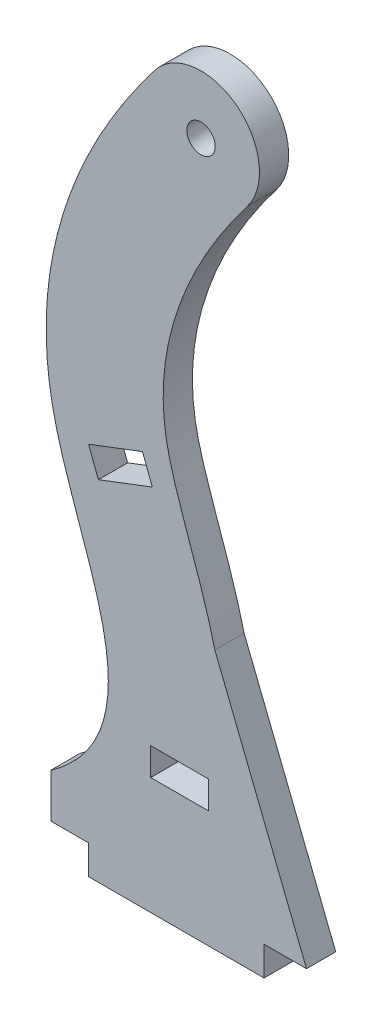
ISO-10303-21;
HEADER;
FILE_DESCRIPTION(('STEP AP214'),'2;1');
FILE_NAME('part.step','',(''),(''),'','','');
FILE_SCHEMA(('AUTOMOTIVE_DESIGN { 1 0 10303 214 1 1 1 1 }'));
ENDSEC;
DATA;
#1=APPLICATION_CONTEXT('core data for automotive mechanical design processes');
#2=APPLICATION_PROTOCOL_DEFINITION('international standard','automotive_design',2000,#1);
#3=PRODUCT_CONTEXT('',#1,'mechanical');
#4=PRODUCT('Part','Part','',(#3));
#5=PRODUCT_RELATED_PRODUCT_CATEGORY('part','',(#4));
#6=PRODUCT_DEFINITION_FORMATION('','',#4);
#7=PRODUCT_DEFINITION_CONTEXT('part definition',#1,'design');
#8=PRODUCT_DEFINITION('design','',#6,#7);
#9=PRODUCT_DEFINITION_SHAPE('','',#8);
#10=(LENGTH_UNIT() NAMED_UNIT(*) SI_UNIT(.MILLI.,.METRE.));
#11=(NAMED_UNIT(*) PLANE_ANGLE_UNIT() SI_UNIT($,.RADIAN.));
#12=(NAMED_UNIT(*) SI_UNIT($,.STERADIAN.) SOLID_ANGLE_UNIT());
#13=UNCERTAINTY_MEASURE_WITH_UNIT(LENGTH_MEASURE(1.E-05),#10,'distance_accuracy_value','');
#14=(GEOMETRIC_REPRESENTATION_CONTEXT(3) GLOBAL_UNCERTAINTY_ASSIGNED_CONTEXT((#13)) GLOBAL_UNIT_ASSIGNED_CONTEXT((#10,
#11,#12)) REPRESENTATION_CONTEXT('',''));
#15=CARTESIAN_POINT('',(0.,0.,0.));
#16=DIRECTION('',(0.,0.,1.));
#17=DIRECTION('',(1.,0.,0.));
#18=AXIS2_PLACEMENT_3D('',#15,#16,#17);
#19=CARTESIAN_POINT('',(25.0101807006285,84.5536828977521,6.35));
#20=DIRECTION('',(0.,0.,-1.));
#21=DIRECTION('',(-1.,0.,0.));
#22=AXIS2_PLACEMENT_3D('',#19,#20,#21);
#23=PLANE('',#22);
#24=DIRECTION('',(-0.934118417079502,-0.35696327944606,0.));
#25=VECTOR('',#24,1.);
#26=CARTESIAN_POINT('',(8.17063216998378,74.9558549784725,6.35));
#27=LINE('',#26,#25);
#28=CARTESIAN_POINT('',(19.8678498123375,79.4258205563523,6.35));
#29=VERTEX_POINT('',#28);
#30=CARTESIAN_POINT('',(8.17063216998378,74.9558549784725,6.35));
#31=VERTEX_POINT('',#30);
#32=EDGE_CURVE('E195',#29,#31,#27,.T.);
#33=ORIENTED_EDGE('',*,*,#32,.F.);
#34=DIRECTION('',(-0.356963279446075,0.934118417079496,0.));
#35=VECTOR('',#34,1.);
#36=CARTESIAN_POINT('',(19.8678498123375,79.4258205563523,6.35));
#37=LINE('',#36,#35);
#38=CARTESIAN_POINT('',(22.0076304946488,73.8263411170115,6.35));
#39=VERTEX_POINT('',#38);
#40=EDGE_CURVE('E203',#39,#29,#37,.T.);
#41=ORIENTED_EDGE('',*,*,#40,.F.);
#42=DIRECTION('',(0.934118417079486,0.356963279446101,0.));
#43=VECTOR('',#42,1.);
#44=CARTESIAN_POINT('',(10.3104128522954,69.3563755391312,6.35));
#45=LINE('',#44,#43);
#46=CARTESIAN_POINT('',(10.3104128522954,69.3563755391312,6.35));
#47=VERTEX_POINT('',#46);
#48=EDGE_CURVE('E200',#47,#39,#45,.T.);
#49=ORIENTED_EDGE('',*,*,#48,.F.);
#50=DIRECTION('',(0.356963279446085,-0.934118417079492,0.));
#51=VECTOR('',#50,1.);
#52=CARTESIAN_POINT('',(8.17063216998378,74.9558549784725,6.35));
#53=LINE('',#52,#51);
#54=EDGE_CURVE('E197',#31,#47,#53,.T.);
#55=ORIENTED_EDGE('',*,*,#54,.F.);
#56=EDGE_LOOP('',(#33,#41,#49,#55));
#57=FACE_BOUND('',#56,.T.);
#58=DIRECTION('',(0.,-1.,0.));
#59=VECTOR('',#58,1.);
#60=CARTESIAN_POINT('',(0.,9.58967568861893,6.35));
#61=LINE('',#60,#59);
#62=CARTESIAN_POINT('',(0.,9.58967568861893,6.35));
#63=VERTEX_POINT('',#62);
#64=CARTESIAN_POINT('',(0.,0.,6.35));
#65=VERTEX_POINT('',#64);
#66=EDGE_CURVE('E232',#63,#65,#61,.T.);
#67=ORIENTED_EDGE('',*,*,#66,.T.);
#68=DIRECTION('',(1.,0.,0.));
#69=VECTOR('',#68,1.);
#70=CARTESIAN_POINT('',(0.,0.,6.35));
#71=LINE('',#70,#69);
#72=CARTESIAN_POINT('',(8.17063216998378,0.,6.35));
#73=VERTEX_POINT('',#72);
#74=EDGE_CURVE('E235',#65,#73,#71,.T.);
#75=ORIENTED_EDGE('',*,*,#74,.T.);
#76=DIRECTION('',(0.,-1.,0.));
#77=VECTOR('',#76,1.);
#78=CARTESIAN_POINT('',(8.17063216998378,0.,6.35));
#79=LINE('',#78,#77);
#80=CARTESIAN_POINT('',(8.17063216998378,-6.35,6.35));
#81=VERTEX_POINT('',#80);
#82=EDGE_CURVE('E238',#73,#81,#79,.T.);
#83=ORIENTED_EDGE('',*,*,#82,.T.);
#84=DIRECTION('',(1.,0.,0.));
#85=VECTOR('',#84,1.);
#86=CARTESIAN_POINT('',(8.17063216998378,-6.35,6.35));
#87=LINE('',#86,#85);
#88=CARTESIAN_POINT('',(46.2706321699838,-6.35,6.35));
#89=VERTEX_POINT('',#88);
#90=EDGE_CURVE('E240',#81,#89,#87,.T.);
#91=ORIENTED_EDGE('',*,*,#90,.T.);
#92=DIRECTION('',(0.,1.,0.));
#93=VECTOR('',#92,1.);
#94=CARTESIAN_POINT('',(46.2706321699838,-6.35,6.35));
#95=LINE('',#94,#93);
#96=CARTESIAN_POINT('',(46.2706321699838,0.,6.35));
#97=VERTEX_POINT('',#96);
#98=EDGE_CURVE('E242',#89,#97,#95,.T.);
#99=ORIENTED_EDGE('',*,*,#98,.T.);
#100=DIRECTION('',(1.,0.,0.));
#101=VECTOR('',#100,1.);
#102=CARTESIAN_POINT('',(46.2706321699838,0.,6.35));
#103=LINE('',#102,#101);
#104=CARTESIAN_POINT('',(55.4885743427861,0.,6.35));
#105=VERTEX_POINT('',#104);
#106=EDGE_CURVE('E244',#97,#105,#103,.T.);
#107=ORIENTED_EDGE('',*,*,#106,.T.);
#108=CARTESIAN_POINT('',(55.4885743427861,0.,6.35));
#109=CARTESIAN_POINT('',(35.5939281580711,49.9715125701587,6.35));
#110=B_SPLINE_CURVE_WITH_KNOTS('',1,(#108,#109),.UNSPECIFIED.,.F.,.F.,(2,2),(0.,1.),.UNSPECIFIED.);
#111=CARTESIAN_POINT('',(35.5939281580711,49.9715125701587,6.35));
#112=VERTEX_POINT('',#111);
#113=EDGE_CURVE('E246',#105,#112,#110,.T.);
#114=ORIENTED_EDGE('',*,*,#113,.T.);
#115=CARTESIAN_POINT('',(14.6386440832059,-11.1677350219014,6.35));
#116=CARTESIAN_POINT('',(15.993719372111,-10.2121021090652,6.35));
#117=CARTESIAN_POINT('',(18.6402892410642,-8.1940524023132,6.35));
#118=CARTESIAN_POINT('',(23.5424406836985,-3.78692886840914,6.35));
#119=CARTESIAN_POINT('',(28.8938100236488,2.46550629347578,6.35));
#120=CARTESIAN_POINT('',(33.6864094872974,10.9103784146669,6.35));
#121=CARTESIAN_POINT('',(36.6378927286633,19.7198119349582,6.35));
#122=CARTESIAN_POINT('',(37.9073212789025,28.2753270232658,6.35));
#123=CARTESIAN_POINT('',(37.894551928186,37.5741979738703,6.35));
#124=CARTESIAN_POINT('',(36.6428624642127,45.8140619811913,6.35));
#125=CARTESIAN_POINT('',(34.5822500472398,54.1219459431517,6.35));
#126=CARTESIAN_POINT('',(31.957417171032,62.3483443135577,6.35));
#127=CARTESIAN_POINT('',(29.4490520894029,69.3391781164023,6.35));
#128=CARTESIAN_POINT('',(27.5788127696835,74.8012961992338,6.35));
#129=CARTESIAN_POINT('',(26.4239352428472,78.4798507817565,6.35));
#130=CARTESIAN_POINT('',(25.5548509095228,81.728738298571,6.35));
#131=CARTESIAN_POINT('',(24.7882337027435,85.4836599545439,6.35));
#132=CARTESIAN_POINT('',(24.284352637122,90.3086123825321,6.35));
#133=CARTESIAN_POINT('',(24.4281830062934,96.2033561498626,6.35));
#134=CARTESIAN_POINT('',(25.3275851118725,102.354497695581,6.35));
#135=CARTESIAN_POINT('',(27.029689584325,108.787993916917,6.35));
#136=CARTESIAN_POINT('',(29.5776249981555,115.505437796637,6.35));
#137=CARTESIAN_POINT('',(32.4312242663498,121.30914400608,6.35));
#138=CARTESIAN_POINT('',(35.1580660147539,126.048842881338,6.35));
#139=CARTESIAN_POINT('',(37.4240805437192,129.643418636195,6.35));
#140=CARTESIAN_POINT('',(39.4975569447407,132.668231109225,6.35));
#141=CARTESIAN_POINT('',(41.2616819639979,135.095684908051,6.35));
#142=CARTESIAN_POINT('',(42.1865011732246,136.321547482478,6.35));
#143=CARTESIAN_POINT('',(42.6515160265804,136.926910036438,6.35));
#144=B_SPLINE_CURVE_WITH_KNOTS('',3,(#115,#116,#117,#118,#119,#120,#121,#122,#123,#124,#125,
#126,#127,#128,#129,#130,#131,#132,#133,#134,#135,#136,#137,#138,#139,#140,#141,#142,#143),
.UNSPECIFIED.,.F.,.F.,(4,1,1,1,1,1,1,1,1,1,1,1,1,1,1,1,1,1,1,1,1,1,1,1,1,1,4),(0.,0.015625,
0.03125,0.0625,0.09375,0.125,0.15625,0.1875,0.234812185903787,0.266062185903787,0.3125,0.375,
0.40625,0.4375,0.46875,0.5,0.5625,0.625,0.6875,0.75,0.8125,0.875,0.90625,0.9375,0.96875,
0.984375,1.),.UNSPECIFIED.);
#145=CARTESIAN_POINT('',(42.6515160265804,136.926910036438,6.35));
#146=VERTEX_POINT('',#145);
#147=EDGE_CURVE('E250',#112,#146,#144,.T.);
#148=ORIENTED_EDGE('',*,*,#147,.T.);
#149=CARTESIAN_POINT('',(32.5799783214988,144.663455018219,6.35));
#150=DIRECTION('',(0.,0.,1.));
#151=DIRECTION('',(1.,0.,0.));
#152=AXIS2_PLACEMENT_3D('',#149,#150,#151);
#153=CIRCLE('',#152,12.7);
#154=CARTESIAN_POINT('',(22.5084406164172,152.4,6.35));
#155=VERTEX_POINT('',#154);
#156=EDGE_CURVE('E258',#146,#155,#153,.T.);
#157=ORIENTED_EDGE('',*,*,#156,.T.);
#158=CARTESIAN_POINT('',(22.5084406164172,152.4,6.35));
#159=CARTESIAN_POINT('',(3.94143346930532,128.229221830543,6.35));
#160=CARTESIAN_POINT('',(-7.63631862598279,94.0640014836905,6.35));
#161=CARTESIAN_POINT('',(11.3620522019621,46.5973364864593,6.35));
#162=CARTESIAN_POINT('',(16.9507047245258,21.5437357051744,6.35));
#163=CARTESIAN_POINT('',(0.,9.58967568861893,6.35));
#164=B_SPLINE_CURVE_WITH_KNOTS('',3,(#158,#159,#160,#161,#162,#163),.UNSPECIFIED.,.F.,.F.,(4,1,
1,4),(0.,0.519720096410352,0.687181480825465,1.),.UNSPECIFIED.);
#165=EDGE_CURVE('E314',#155,#63,#164,.T.);
#166=ORIENTED_EDGE('',*,*,#165,.T.);
#167=EDGE_LOOP('',(#67,#75,#83,#91,#99,#107,#114,#148,#157,#166));
#168=FACE_BOUND('',#167,.T.);
#169=CARTESIAN_POINT('',(32.5799783214988,144.663455018219,6.35));
#170=DIRECTION('',(0.,0.,1.));
#171=DIRECTION('',(1.,0.,0.));
#172=AXIS2_PLACEMENT_3D('',#169,#170,#171);
#173=CIRCLE('',#172,3.0861);
#174=CARTESIAN_POINT('',(35.6660783214988,144.663455018219,6.35));
#175=VERTEX_POINT('',#174);
#176=EDGE_CURVE('E226',#175,#175,#173,.T.);
#177=ORIENTED_EDGE('',*,*,#176,.F.);
#178=EDGE_LOOP('',(#177));
#179=FACE_BOUND('',#178,.T.);
#180=DIRECTION('',(0.,-1.,0.));
#181=VECTOR('',#180,1.);
#182=CARTESIAN_POINT('',(21.6637442400915,25.0331161416837,6.35));
#183=LINE('',#182,#181);
#184=CARTESIAN_POINT('',(21.6637442400915,25.0331161416837,6.35));
#185=VERTEX_POINT('',#184);
#186=CARTESIAN_POINT('',(21.6637442400915,19.0387161416837,6.35));
#187=VERTEX_POINT('',#186);
#188=EDGE_CURVE('E159',#185,#187,#183,.T.);
#189=ORIENTED_EDGE('',*,*,#188,.F.);
#190=DIRECTION('',(-1.,0.,0.));
#191=VECTOR('',#190,1.);
#192=CARTESIAN_POINT('',(21.6637442400915,25.0331161416837,6.35));
#193=LINE('',#192,#191);
#194=CARTESIAN_POINT('',(34.1859442400915,25.0331161416837,6.35));
#195=VERTEX_POINT('',#194);
#196=EDGE_CURVE('E181',#195,#185,#193,.T.);
#197=ORIENTED_EDGE('',*,*,#196,.F.);
#198=DIRECTION('',(0.,1.,0.));
#199=VECTOR('',#198,1.);
#200=CARTESIAN_POINT('',(34.1859442400915,25.0331161416837,6.35));
#201=LINE('',#200,#199);
#202=CARTESIAN_POINT('',(34.1859442400915,19.0387161416837,6.35));
#203=VERTEX_POINT('',#202);
#204=EDGE_CURVE('E179',#203,#195,#201,.T.);
#205=ORIENTED_EDGE('',*,*,#204,.F.);
#206=DIRECTION('',(1.,0.,0.));
#207=VECTOR('',#206,1.);
#208=CARTESIAN_POINT('',(21.6637442400915,19.0387161416837,6.35));
#209=LINE('',#208,#207);
#210=EDGE_CURVE('E167',#187,#203,#209,.T.);
#211=ORIENTED_EDGE('',*,*,#210,.F.);
#212=EDGE_LOOP('',(#189,#197,#205,#211));
#213=FACE_BOUND('',#212,.T.);
#214=ADVANCED_FACE('F34',(#57,#168,#179,#213),#23,.F.);
#215=CARTESIAN_POINT('',(25.0101807006285,84.5536828977521,0.));
#216=DIRECTION('',(0.,0.,-1.));
#217=DIRECTION('',(-1.,0.,0.));
#218=AXIS2_PLACEMENT_3D('',#215,#216,#217);
#219=PLANE('',#218);
#220=DIRECTION('',(0.,-1.,0.));
#221=VECTOR('',#220,1.);
#222=CARTESIAN_POINT('',(0.,9.58967568861893,0.));
#223=LINE('',#222,#221);
#224=CARTESIAN_POINT('',(0.,9.58967568861893,0.));
#225=VERTEX_POINT('',#224);
#226=CARTESIAN_POINT('',(0.,0.,0.));
#227=VERTEX_POINT('',#226);
#228=EDGE_CURVE('E229',#225,#227,#223,.T.);
#229=ORIENTED_EDGE('',*,*,#228,.F.);
#230=CARTESIAN_POINT('',(22.5084406164172,152.4,0.));
#231=CARTESIAN_POINT('',(3.94143346930532,128.229221830543,0.));
#232=CARTESIAN_POINT('',(-7.63631862598279,94.0640014836905,0.));
#233=CARTESIAN_POINT('',(11.3620522019621,46.5973364864593,0.));
#234=CARTESIAN_POINT('',(16.9507047245258,21.5437357051744,0.));
#235=CARTESIAN_POINT('',(0.,9.58967568861893,0.));
#236=B_SPLINE_CURVE_WITH_KNOTS('',3,(#230,#231,#232,#233,#234,#235),.UNSPECIFIED.,.F.,.F.,(4,1,
1,4),(0.,0.519720096410352,0.687181480825465,1.),.UNSPECIFIED.);
#237=CARTESIAN_POINT('',(22.5084406164172,152.4,0.));
#238=VERTEX_POINT('',#237);
#239=EDGE_CURVE('E236',#238,#225,#236,.T.);
#240=ORIENTED_EDGE('',*,*,#239,.F.);
#241=CARTESIAN_POINT('',(32.5799783214988,144.663455018219,0.));
#242=DIRECTION('',(0.,0.,1.));
#243=DIRECTION('',(1.,0.,0.));
#244=AXIS2_PLACEMENT_3D('',#241,#242,#243);
#245=CIRCLE('',#244,12.7);
#246=CARTESIAN_POINT('',(42.6515160265804,136.926910036438,0.));
#247=VERTEX_POINT('',#246);
#248=EDGE_CURVE('E346',#247,#238,#245,.T.);
#249=ORIENTED_EDGE('',*,*,#248,.F.);
#250=CARTESIAN_POINT('',(14.6386440832059,-11.1677350219014,0.));
#251=CARTESIAN_POINT('',(15.993719372111,-10.2121021090652,0.));
#252=CARTESIAN_POINT('',(18.6402892410642,-8.1940524023132,0.));
#253=CARTESIAN_POINT('',(23.5424406836985,-3.78692886840914,0.));
#254=CARTESIAN_POINT('',(28.8938100236488,2.46550629347578,0.));
#255=CARTESIAN_POINT('',(33.6864094872974,10.9103784146669,0.));
#256=CARTESIAN_POINT('',(36.6378927286633,19.7198119349582,0.));
#257=CARTESIAN_POINT('',(37.9073212789025,28.2753270232658,0.));
#258=CARTESIAN_POINT('',(37.894551928186,37.5741979738703,0.));
#259=CARTESIAN_POINT('',(36.6428624642127,45.8140619811913,0.));
#260=CARTESIAN_POINT('',(34.5822500472398,54.1219459431517,0.));
#261=CARTESIAN_POINT('',(31.957417171032,62.3483443135577,0.));
#262=CARTESIAN_POINT('',(29.4490520894029,69.3391781164023,0.));
#263=CARTESIAN_POINT('',(27.5788127696835,74.8012961992338,0.));
#264=CARTESIAN_POINT('',(26.4239352428472,78.4798507817565,0.));
#265=CARTESIAN_POINT('',(25.5548509095228,81.728738298571,0.));
#266=CARTESIAN_POINT('',(24.7882337027435,85.4836599545439,0.));
#267=CARTESIAN_POINT('',(24.284352637122,90.3086123825321,0.));
#268=CARTESIAN_POINT('',(24.4281830062934,96.2033561498626,0.));
#269=CARTESIAN_POINT('',(25.3275851118725,102.354497695581,0.));
#270=CARTESIAN_POINT('',(27.029689584325,108.787993916917,0.));
#271=CARTESIAN_POINT('',(29.5776249981555,115.505437796637,0.));
#272=CARTESIAN_POINT('',(32.4312242663498,121.30914400608,0.));
#273=CARTESIAN_POINT('',(35.1580660147539,126.048842881338,0.));
#274=CARTESIAN_POINT('',(37.4240805437192,129.643418636195,0.));
#275=CARTESIAN_POINT('',(39.4975569447407,132.668231109225,0.));
#276=CARTESIAN_POINT('',(41.2616819639979,135.095684908051,0.));
#277=CARTESIAN_POINT('',(42.1865011732246,136.321547482478,0.));
#278=CARTESIAN_POINT('',(42.6515160265804,136.926910036438,0.));
#279=B_SPLINE_CURVE_WITH_KNOTS('',3,(#250,#251,#252,#253,#254,#255,#256,#257,#258,#259,#260,
#261,#262,#263,#264,#265,#266,#267,#268,#269,#270,#271,#272,#273,#274,#275,#276,#277,#278),
.UNSPECIFIED.,.F.,.F.,(4,1,1,1,1,1,1,1,1,1,1,1,1,1,1,1,1,1,1,1,1,1,1,1,1,1,4),(0.,0.015625,
0.03125,0.0625,0.09375,0.125,0.15625,0.1875,0.234812185903787,0.266062185903787,0.3125,0.375,
0.40625,0.4375,0.46875,0.5,0.5625,0.625,0.6875,0.75,0.8125,0.875,0.90625,0.9375,0.96875,
0.984375,1.),.UNSPECIFIED.);
#280=CARTESIAN_POINT('',(35.5939281580711,49.9715125701587,0.));
#281=VERTEX_POINT('',#280);
#282=EDGE_CURVE('E339',#281,#247,#279,.T.);
#283=ORIENTED_EDGE('',*,*,#282,.F.);
#284=CARTESIAN_POINT('',(55.4885743427861,0.,0.));
#285=CARTESIAN_POINT('',(35.5939281580711,49.9715125701587,0.));
#286=B_SPLINE_CURVE_WITH_KNOTS('',1,(#284,#285),.UNSPECIFIED.,.F.,.F.,(2,2),(0.,1.),.UNSPECIFIED.);
#287=CARTESIAN_POINT('',(55.4885743427861,0.,0.));
#288=VERTEX_POINT('',#287);
#289=EDGE_CURVE('E335',#288,#281,#286,.T.);
#290=ORIENTED_EDGE('',*,*,#289,.F.);
#291=DIRECTION('',(1.,0.,0.));
#292=VECTOR('',#291,1.);
#293=CARTESIAN_POINT('',(46.2706321699838,0.,0.));
#294=LINE('',#293,#292);
#295=CARTESIAN_POINT('',(46.2706321699838,0.,0.));
#296=VERTEX_POINT('',#295);
#297=EDGE_CURVE('E333',#296,#288,#294,.T.);
#298=ORIENTED_EDGE('',*,*,#297,.F.);
#299=DIRECTION('',(0.,1.,0.));
#300=VECTOR('',#299,1.);
#301=CARTESIAN_POINT('',(46.2706321699838,-6.35,0.));
#302=LINE('',#301,#300);
#303=CARTESIAN_POINT('',(46.2706321699838,-6.35,0.));
#304=VERTEX_POINT('',#303);
#305=EDGE_CURVE('E331',#304,#296,#302,.T.);
#306=ORIENTED_EDGE('',*,*,#305,.F.);
#307=DIRECTION('',(1.,0.,0.));
#308=VECTOR('',#307,1.);
#309=CARTESIAN_POINT('',(8.17063216998378,-6.35,0.));
#310=LINE('',#309,#308);
#311=CARTESIAN_POINT('',(8.17063216998378,-6.35,0.));
#312=VERTEX_POINT('',#311);
#313=EDGE_CURVE('E329',#312,#304,#310,.T.);
#314=ORIENTED_EDGE('',*,*,#313,.F.);
#315=DIRECTION('',(0.,-1.,0.));
#316=VECTOR('',#315,1.);
#317=CARTESIAN_POINT('',(8.17063216998378,0.,0.));
#318=LINE('',#317,#316);
#319=CARTESIAN_POINT('',(8.17063216998378,0.,0.));
#320=VERTEX_POINT('',#319);
#321=EDGE_CURVE('E327',#320,#312,#318,.T.);
#322=ORIENTED_EDGE('',*,*,#321,.F.);
#323=DIRECTION('',(1.,0.,0.));
#324=VECTOR('',#323,1.);
#325=CARTESIAN_POINT('',(0.,0.,0.));
#326=LINE('',#325,#324);
#327=EDGE_CURVE('E325',#227,#320,#326,.T.);
#328=ORIENTED_EDGE('',*,*,#327,.F.);
#329=EDGE_LOOP('',(#229,#240,#249,#283,#290,#298,#306,#314,#322,#328));
#330=FACE_BOUND('',#329,.T.);
#331=CARTESIAN_POINT('',(32.5799783214988,144.663455018219,0.));
#332=DIRECTION('',(0.,0.,1.));
#333=DIRECTION('',(1.,0.,0.));
#334=AXIS2_PLACEMENT_3D('',#331,#332,#333);
#335=CIRCLE('',#334,3.0861);
#336=CARTESIAN_POINT('',(35.6660783214988,144.663455018219,0.));
#337=VERTEX_POINT('',#336);
#338=EDGE_CURVE('E225',#337,#337,#335,.T.);
#339=ORIENTED_EDGE('',*,*,#338,.T.);
#340=EDGE_LOOP('',(#339));
#341=FACE_BOUND('',#340,.T.);
#342=DIRECTION('',(-0.356963279446075,0.934118417079496,0.));
#343=VECTOR('',#342,1.);
#344=CARTESIAN_POINT('',(19.8678498123375,79.4258205563523,0.));
#345=LINE('',#344,#343);
#346=CARTESIAN_POINT('',(22.0076304946488,73.8263411170115,0.));
#347=VERTEX_POINT('',#346);
#348=CARTESIAN_POINT('',(19.8678498123375,79.4258205563523,0.));
#349=VERTEX_POINT('',#348);
#350=EDGE_CURVE('E198',#347,#349,#345,.T.);
#351=ORIENTED_EDGE('',*,*,#350,.T.);
#352=DIRECTION('',(-0.934118417079502,-0.35696327944606,0.));
#353=VECTOR('',#352,1.);
#354=CARTESIAN_POINT('',(8.17063216998378,74.9558549784725,0.));
#355=LINE('',#354,#353);
#356=CARTESIAN_POINT('',(8.17063216998378,74.9558549784725,0.));
#357=VERTEX_POINT('',#356);
#358=EDGE_CURVE('E175',#349,#357,#355,.T.);
#359=ORIENTED_EDGE('',*,*,#358,.T.);
#360=DIRECTION('',(0.356963279446085,-0.934118417079492,0.));
#361=VECTOR('',#360,1.);
#362=CARTESIAN_POINT('',(8.17063216998378,74.9558549784725,0.));
#363=LINE('',#362,#361);
#364=CARTESIAN_POINT('',(10.3104128522954,69.3563755391312,0.));
#365=VERTEX_POINT('',#364);
#366=EDGE_CURVE('E208',#357,#365,#363,.T.);
#367=ORIENTED_EDGE('',*,*,#366,.T.);
#368=DIRECTION('',(0.934118417079486,0.356963279446101,0.));
#369=VECTOR('',#368,1.);
#370=CARTESIAN_POINT('',(10.3104128522954,69.3563755391312,0.));
#371=LINE('',#370,#369);
#372=EDGE_CURVE('E211',#365,#347,#371,.T.);
#373=ORIENTED_EDGE('',*,*,#372,.T.);
#374=EDGE_LOOP('',(#351,#359,#367,#373));
#375=FACE_BOUND('',#374,.T.);
#376=DIRECTION('',(-1.,0.,0.));
#377=VECTOR('',#376,1.);
#378=CARTESIAN_POINT('',(21.6637442400915,25.0331161416837,0.));
#379=LINE('',#378,#377);
#380=CARTESIAN_POINT('',(34.1859442400915,25.0331161416837,0.));
#381=VERTEX_POINT('',#380);
#382=CARTESIAN_POINT('',(21.6637442400915,25.0331161416837,0.));
#383=VERTEX_POINT('',#382);
#384=EDGE_CURVE('E168',#381,#383,#379,.T.);
#385=ORIENTED_EDGE('',*,*,#384,.T.);
#386=DIRECTION('',(0.,-1.,0.));
#387=VECTOR('',#386,1.);
#388=CARTESIAN_POINT('',(21.6637442400915,25.0331161416837,0.));
#389=LINE('',#388,#387);
#390=CARTESIAN_POINT('',(21.6637442400915,19.0387161416837,0.));
#391=VERTEX_POINT('',#390);
#392=EDGE_CURVE('E57',#383,#391,#389,.T.);
#393=ORIENTED_EDGE('',*,*,#392,.T.);
#394=DIRECTION('',(1.,0.,0.));
#395=VECTOR('',#394,1.);
#396=CARTESIAN_POINT('',(21.6637442400915,19.0387161416837,0.));
#397=LINE('',#396,#395);
#398=CARTESIAN_POINT('',(34.1859442400915,19.0387161416837,0.));
#399=VERTEX_POINT('',#398);
#400=EDGE_CURVE('E174',#391,#399,#397,.T.);
#401=ORIENTED_EDGE('',*,*,#400,.T.);
#402=DIRECTION('',(0.,1.,0.));
#403=VECTOR('',#402,1.);
#404=CARTESIAN_POINT('',(34.1859442400915,25.0331161416837,0.));
#405=LINE('',#404,#403);
#406=EDGE_CURVE('E187',#399,#381,#405,.T.);
#407=ORIENTED_EDGE('',*,*,#406,.T.);
#408=EDGE_LOOP('',(#385,#393,#401,#407));
#409=FACE_BOUND('',#408,.T.);
#410=ADVANCED_FACE('F296',(#330,#341,#375,#409),#219,.T.);
#411=CARTESIAN_POINT('',(0.,9.58967568861893,6.35));
#412=DIRECTION('',(1.,0.,0.));
#413=DIRECTION('',(0.,0.,-1.));
#414=AXIS2_PLACEMENT_3D('',#411,#412,#413);
#415=PLANE('',#414);
#416=ORIENTED_EDGE('',*,*,#228,.T.);
#417=DIRECTION('',(0.,0.,-1.));
#418=VECTOR('',#417,1.);
#419=CARTESIAN_POINT('',(0.,0.,6.35));
#420=LINE('',#419,#418);
#421=EDGE_CURVE('E11',#65,#227,#420,.T.);
#422=ORIENTED_EDGE('',*,*,#421,.F.);
#423=ORIENTED_EDGE('',*,*,#66,.F.);
#424=DIRECTION('',(0.,0.,-1.));
#425=VECTOR('',#424,1.);
#426=CARTESIAN_POINT('',(0.,9.58967568861893,6.35));
#427=LINE('',#426,#425);
#428=EDGE_CURVE('E319',#63,#225,#427,.T.);
#429=ORIENTED_EDGE('',*,*,#428,.T.);
#430=EDGE_LOOP('',(#416,#422,#423,#429));
#431=FACE_BOUND('',#430,.T.);
#432=ADVANCED_FACE('F36',(#431),#415,.F.);
#433=CARTESIAN_POINT('',(0.,0.,6.35));
#434=DIRECTION('',(0.,1.,0.));
#435=DIRECTION('',(-1.,0.,0.));
#436=AXIS2_PLACEMENT_3D('',#433,#434,#435);
#437=PLANE('',#436);
#438=ORIENTED_EDGE('',*,*,#327,.T.);
#439=DIRECTION('',(0.,0.,-1.));
#440=VECTOR('',#439,1.);
#441=CARTESIAN_POINT('',(8.17063216998378,0.,6.35));
#442=LINE('',#441,#440);
#443=EDGE_CURVE('E42',#73,#320,#442,.T.);
#444=ORIENTED_EDGE('',*,*,#443,.F.);
#445=ORIENTED_EDGE('',*,*,#74,.F.);
#446=ORIENTED_EDGE('',*,*,#421,.T.);
#447=EDGE_LOOP('',(#438,#444,#445,#446));
#448=FACE_BOUND('',#447,.T.);
#449=ADVANCED_FACE('F289',(#448),#437,.F.);
#450=CARTESIAN_POINT('',(8.17063216998378,0.,6.35));
#451=DIRECTION('',(1.,0.,0.));
#452=DIRECTION('',(0.,1.,0.));
#453=AXIS2_PLACEMENT_3D('',#450,#451,#452);
#454=PLANE('',#453);
#455=ORIENTED_EDGE('',*,*,#321,.T.);
#456=DIRECTION('',(0.,0.,-1.));
#457=VECTOR('',#456,1.);
#458=CARTESIAN_POINT('',(8.17063216998378,-6.35,6.35));
#459=LINE('',#458,#457);
#460=EDGE_CURVE('E377',#81,#312,#459,.T.);
#461=ORIENTED_EDGE('',*,*,#460,.F.);
#462=ORIENTED_EDGE('',*,*,#82,.F.);
#463=ORIENTED_EDGE('',*,*,#443,.T.);
#464=EDGE_LOOP('',(#455,#461,#462,#463));
#465=FACE_BOUND('',#464,.T.);
#466=ADVANCED_FACE('F286',(#465),#454,.F.);
#467=CARTESIAN_POINT('',(8.17063216998378,-6.35,6.35));
#468=DIRECTION('',(0.,1.,0.));
#469=DIRECTION('',(0.,0.,1.));
#470=AXIS2_PLACEMENT_3D('',#467,#468,#469);
#471=PLANE('',#470);
#472=ORIENTED_EDGE('',*,*,#313,.T.);
#473=DIRECTION('',(0.,0.,-1.));
#474=VECTOR('',#473,1.);
#475=CARTESIAN_POINT('',(46.2706321699838,-6.35,6.35));
#476=LINE('',#475,#474);
#477=EDGE_CURVE('E374',#89,#304,#476,.T.);
#478=ORIENTED_EDGE('',*,*,#477,.F.);
#479=ORIENTED_EDGE('',*,*,#90,.F.);
#480=ORIENTED_EDGE('',*,*,#460,.T.);
#481=EDGE_LOOP('',(#472,#478,#479,#480));
#482=FACE_BOUND('',#481,.T.);
#483=ADVANCED_FACE('F282',(#482),#471,.F.);
#484=CARTESIAN_POINT('',(46.2706321699838,-6.35,6.35));
#485=DIRECTION('',(-1.,0.,0.));
#486=DIRECTION('',(0.,0.,1.));
#487=AXIS2_PLACEMENT_3D('',#484,#485,#486);
#488=PLANE('',#487);
#489=ORIENTED_EDGE('',*,*,#305,.T.);
#490=DIRECTION('',(0.,0.,-1.));
#491=VECTOR('',#490,1.);
#492=CARTESIAN_POINT('',(46.2706321699838,0.,6.35));
#493=LINE('',#492,#491);
#494=EDGE_CURVE('E371',#97,#296,#493,.T.);
#495=ORIENTED_EDGE('',*,*,#494,.F.);
#496=ORIENTED_EDGE('',*,*,#98,.F.);
#497=ORIENTED_EDGE('',*,*,#477,.T.);
#498=EDGE_LOOP('',(#489,#495,#496,#497));
#499=FACE_BOUND('',#498,.T.);
#500=ADVANCED_FACE('F278',(#499),#488,.F.);
#501=CARTESIAN_POINT('',(46.2706321699838,0.,6.35));
#502=DIRECTION('',(0.,1.,0.));
#503=DIRECTION('',(0.,0.,1.));
#504=AXIS2_PLACEMENT_3D('',#501,#502,#503);
#505=PLANE('',#504);
#506=ORIENTED_EDGE('',*,*,#297,.T.);
#507=DIRECTION('',(0.,0.,-1.));
#508=VECTOR('',#507,1.);
#509=CARTESIAN_POINT('',(55.4885743427861,0.,6.35));
#510=LINE('',#509,#508);
#511=EDGE_CURVE('E368',#105,#288,#510,.T.);
#512=ORIENTED_EDGE('',*,*,#511,.F.);
#513=ORIENTED_EDGE('',*,*,#106,.F.);
#514=ORIENTED_EDGE('',*,*,#494,.T.);
#515=EDGE_LOOP('',(#506,#512,#513,#514));
#516=FACE_BOUND('',#515,.T.);
#517=ADVANCED_FACE('F274',(#516),#505,.F.);
#518=CARTESIAN_POINT('',(55.4885743427861,0.,6.35));
#519=DIRECTION('',(-0.92907784783632,-0.369884242243208,0.));
#520=DIRECTION('',(0.369884242243208,-0.92907784783632,0.));
#521=AXIS2_PLACEMENT_3D('',#518,#519,#520);
#522=PLANE('',#521);
#523=ORIENTED_EDGE('',*,*,#289,.T.);
#524=DIRECTION('',(0.,0.,-1.));
#525=VECTOR('',#524,1.);
#526=CARTESIAN_POINT('',(35.5939281580711,49.9715125701587,6.35));
#527=LINE('',#526,#525);
#528=EDGE_CURVE('E365',#112,#281,#527,.T.);
#529=ORIENTED_EDGE('',*,*,#528,.F.);
#530=ORIENTED_EDGE('',*,*,#113,.F.);
#531=ORIENTED_EDGE('',*,*,#511,.T.);
#532=EDGE_LOOP('',(#523,#529,#530,#531));
#533=FACE_BOUND('',#532,.T.);
#534=ADVANCED_FACE('F269',(#533),#522,.F.);
#535=DIRECTION('',(0.,0.,-1.));
#536=VECTOR('',#535,1.);
#537=SURFACE_OF_LINEAR_EXTRUSION('',#144,#536);
#538=ORIENTED_EDGE('',*,*,#282,.T.);
#539=DIRECTION('',(0.,0.,-1.));
#540=VECTOR('',#539,1.);
#541=CARTESIAN_POINT('',(42.6515160265804,136.926910036438,6.35));
#542=LINE('',#541,#540);
#543=EDGE_CURVE('E362',#146,#247,#542,.T.);
#544=ORIENTED_EDGE('',*,*,#543,.F.);
#545=ORIENTED_EDGE('',*,*,#147,.F.);
#546=ORIENTED_EDGE('',*,*,#528,.T.);
#547=EDGE_LOOP('',(#538,#544,#545,#546));
#548=FACE_BOUND('',#547,.T.);
#549=ADVANCED_FACE('F264',(#548),#537,.F.);
#550=CARTESIAN_POINT('',(32.5799783214988,144.663455018219,6.35));
#551=DIRECTION('',(0.,0.,-1.));
#552=DIRECTION('',(-1.,0.,0.));
#553=AXIS2_PLACEMENT_3D('',#550,#551,#552);
#554=CYLINDRICAL_SURFACE('',#553,12.7);
#555=ORIENTED_EDGE('',*,*,#248,.T.);
#556=DIRECTION('',(0.,0.,-1.));
#557=VECTOR('',#556,1.);
#558=CARTESIAN_POINT('',(22.5084406164172,152.4,6.35));
#559=LINE('',#558,#557);
#560=EDGE_CURVE('E359',#155,#238,#559,.T.);
#561=ORIENTED_EDGE('',*,*,#560,.F.);
#562=ORIENTED_EDGE('',*,*,#156,.F.);
#563=ORIENTED_EDGE('',*,*,#543,.T.);
#564=EDGE_LOOP('',(#555,#561,#562,#563));
#565=FACE_BOUND('',#564,.T.);
#566=ADVANCED_FACE('F268',(#565),#554,.T.);
#567=DIRECTION('',(0.,0.,-1.));
#568=VECTOR('',#567,1.);
#569=SURFACE_OF_LINEAR_EXTRUSION('',#164,#568);
#570=ORIENTED_EDGE('',*,*,#239,.T.);
#571=ORIENTED_EDGE('',*,*,#428,.F.);
#572=ORIENTED_EDGE('',*,*,#165,.F.);
#573=ORIENTED_EDGE('',*,*,#560,.T.);
#574=EDGE_LOOP('',(#570,#571,#572,#573));
#575=FACE_BOUND('',#574,.T.);
#576=ADVANCED_FACE('F311',(#575),#569,.F.);
#577=CARTESIAN_POINT('',(32.5799783214988,144.663455018219,6.35));
#578=DIRECTION('',(0.,0.,-1.));
#579=DIRECTION('',(-1.,0.,0.));
#580=AXIS2_PLACEMENT_3D('',#577,#578,#579);
#581=CYLINDRICAL_SURFACE('',#580,3.0861);
#582=ORIENTED_EDGE('',*,*,#176,.T.);
#583=EDGE_LOOP('',(#582));
#584=FACE_BOUND('',#583,.T.);
#585=ORIENTED_EDGE('',*,*,#338,.F.);
#586=EDGE_LOOP('',(#585));
#587=FACE_BOUND('',#586,.T.);
#588=ADVANCED_FACE('F309',(#584,#587),#581,.F.);
#589=CARTESIAN_POINT('',(8.17063216998378,74.9558549784725,6.35));
#590=DIRECTION('',(0.35696327944606,-0.934118417079502,0.));
#591=DIRECTION('',(0.934118417079502,0.35696327944606,0.));
#592=AXIS2_PLACEMENT_3D('',#589,#590,#591);
#593=PLANE('',#592);
#594=ORIENTED_EDGE('',*,*,#358,.F.);
#595=DIRECTION('',(0.,0.,-1.));
#596=VECTOR('',#595,1.);
#597=CARTESIAN_POINT('',(19.8678498123375,79.4258205563523,6.35));
#598=LINE('',#597,#596);
#599=EDGE_CURVE('E205',#29,#349,#598,.T.);
#600=ORIENTED_EDGE('',*,*,#599,.F.);
#601=ORIENTED_EDGE('',*,*,#32,.T.);
#602=DIRECTION('',(0.,0.,-1.));
#603=VECTOR('',#602,1.);
#604=CARTESIAN_POINT('',(8.17063216998378,74.9558549784725,6.35));
#605=LINE('',#604,#603);
#606=EDGE_CURVE('E222',#31,#357,#605,.T.);
#607=ORIENTED_EDGE('',*,*,#606,.T.);
#608=EDGE_LOOP('',(#594,#600,#601,#607));
#609=FACE_BOUND('',#608,.T.);
#610=ADVANCED_FACE('F426',(#609),#593,.T.);
#611=CARTESIAN_POINT('',(8.17063216998378,74.9558549784725,6.35));
#612=DIRECTION('',(0.934118417079492,0.356963279446085,0.));
#613=DIRECTION('',(-0.356963279446085,0.934118417079492,0.));
#614=AXIS2_PLACEMENT_3D('',#611,#612,#613);
#615=PLANE('',#614);
#616=ORIENTED_EDGE('',*,*,#366,.F.);
#617=ORIENTED_EDGE('',*,*,#606,.F.);
#618=ORIENTED_EDGE('',*,*,#54,.T.);
#619=DIRECTION('',(0.,0.,-1.));
#620=VECTOR('',#619,1.);
#621=CARTESIAN_POINT('',(10.3104128522954,69.3563755391312,6.35));
#622=LINE('',#621,#620);
#623=EDGE_CURVE('E220',#47,#365,#622,.T.);
#624=ORIENTED_EDGE('',*,*,#623,.T.);
#625=EDGE_LOOP('',(#616,#617,#618,#624));
#626=FACE_BOUND('',#625,.T.);
#627=ADVANCED_FACE('F433',(#626),#615,.T.);
#628=CARTESIAN_POINT('',(10.3104128522954,69.3563755391312,6.35));
#629=DIRECTION('',(-0.356963279446101,0.934118417079486,0.));
#630=DIRECTION('',(-0.934118417079486,-0.356963279446101,0.));
#631=AXIS2_PLACEMENT_3D('',#628,#629,#630);
#632=PLANE('',#631);
#633=ORIENTED_EDGE('',*,*,#372,.F.);
#634=ORIENTED_EDGE('',*,*,#623,.F.);
#635=ORIENTED_EDGE('',*,*,#48,.T.);
#636=DIRECTION('',(0.,0.,-1.));
#637=VECTOR('',#636,1.);
#638=CARTESIAN_POINT('',(22.0076304946488,73.8263411170115,6.35));
#639=LINE('',#638,#637);
#640=EDGE_CURVE('E218',#39,#347,#639,.T.);
#641=ORIENTED_EDGE('',*,*,#640,.T.);
#642=EDGE_LOOP('',(#633,#634,#635,#641));
#643=FACE_BOUND('',#642,.T.);
#644=ADVANCED_FACE('F440',(#643),#632,.T.);
#645=CARTESIAN_POINT('',(19.8678498123375,79.4258205563523,6.35));
#646=DIRECTION('',(-0.934118417079496,-0.356963279446075,0.));
#647=DIRECTION('',(0.356963279446076,-0.934118417079496,0.));
#648=AXIS2_PLACEMENT_3D('',#645,#646,#647);
#649=PLANE('',#648);
#650=ORIENTED_EDGE('',*,*,#350,.F.);
#651=ORIENTED_EDGE('',*,*,#640,.F.);
#652=ORIENTED_EDGE('',*,*,#40,.T.);
#653=ORIENTED_EDGE('',*,*,#599,.T.);
#654=EDGE_LOOP('',(#650,#651,#652,#653));
#655=FACE_BOUND('',#654,.T.);
#656=ADVANCED_FACE('F448',(#655),#649,.T.);
#657=CARTESIAN_POINT('',(21.6637442400915,25.0331161416837,6.35));
#658=DIRECTION('',(1.,0.,0.));
#659=DIRECTION('',(0.,0.,-1.));
#660=AXIS2_PLACEMENT_3D('',#657,#658,#659);
#661=PLANE('',#660);
#662=ORIENTED_EDGE('',*,*,#392,.F.);
#663=DIRECTION('',(0.,0.,-1.));
#664=VECTOR('',#663,1.);
#665=CARTESIAN_POINT('',(21.6637442400915,25.0331161416837,6.35));
#666=LINE('',#665,#664);
#667=EDGE_CURVE('E163',#185,#383,#666,.T.);
#668=ORIENTED_EDGE('',*,*,#667,.F.);
#669=ORIENTED_EDGE('',*,*,#188,.T.);
#670=DIRECTION('',(0.,0.,-1.));
#671=VECTOR('',#670,1.);
#672=CARTESIAN_POINT('',(21.6637442400915,19.0387161416837,6.35));
#673=LINE('',#672,#671);
#674=EDGE_CURVE('E162',#187,#391,#673,.T.);
#675=ORIENTED_EDGE('',*,*,#674,.T.);
#676=EDGE_LOOP('',(#662,#668,#669,#675));
#677=FACE_BOUND('',#676,.T.);
#678=ADVANCED_FACE('F161',(#677),#661,.T.);
#679=CARTESIAN_POINT('',(21.6637442400915,19.0387161416837,6.35));
#680=DIRECTION('',(0.,1.,0.));
#681=DIRECTION('',(0.,0.,1.));
#682=AXIS2_PLACEMENT_3D('',#679,#680,#681);
#683=PLANE('',#682);
#684=ORIENTED_EDGE('',*,*,#400,.F.);
#685=ORIENTED_EDGE('',*,*,#674,.F.);
#686=ORIENTED_EDGE('',*,*,#210,.T.);
#687=DIRECTION('',(0.,0.,-1.));
#688=VECTOR('',#687,1.);
#689=CARTESIAN_POINT('',(34.1859442400915,19.0387161416837,6.35));
#690=LINE('',#689,#688);
#691=EDGE_CURVE('E176',#203,#399,#690,.T.);
#692=ORIENTED_EDGE('',*,*,#691,.T.);
#693=EDGE_LOOP('',(#684,#685,#686,#692));
#694=FACE_BOUND('',#693,.T.);
#695=ADVANCED_FACE('F171',(#694),#683,.T.);
#696=CARTESIAN_POINT('',(34.1859442400915,25.0331161416837,6.35));
#697=DIRECTION('',(-1.,0.,0.));
#698=DIRECTION('',(0.,0.,1.));
#699=AXIS2_PLACEMENT_3D('',#696,#697,#698);
#700=PLANE('',#699);
#701=ORIENTED_EDGE('',*,*,#406,.F.);
#702=ORIENTED_EDGE('',*,*,#691,.F.);
#703=ORIENTED_EDGE('',*,*,#204,.T.);
#704=DIRECTION('',(0.,0.,-1.));
#705=VECTOR('',#704,1.);
#706=CARTESIAN_POINT('',(34.1859442400915,25.0331161416837,6.35));
#707=LINE('',#706,#705);
#708=EDGE_CURVE('E49',#195,#381,#707,.T.);
#709=ORIENTED_EDGE('',*,*,#708,.T.);
#710=EDGE_LOOP('',(#701,#702,#703,#709));
#711=FACE_BOUND('',#710,.T.);
#712=ADVANCED_FACE('F469',(#711),#700,.T.);
#713=CARTESIAN_POINT('',(21.6637442400915,25.0331161416837,6.35));
#714=DIRECTION('',(0.,-1.,0.));
#715=DIRECTION('',(0.,0.,-1.));
#716=AXIS2_PLACEMENT_3D('',#713,#714,#715);
#717=PLANE('',#716);
#718=ORIENTED_EDGE('',*,*,#384,.F.);
#719=ORIENTED_EDGE('',*,*,#708,.F.);
#720=ORIENTED_EDGE('',*,*,#196,.T.);
#721=ORIENTED_EDGE('',*,*,#667,.T.);
#722=EDGE_LOOP('',(#718,#719,#720,#721));
#723=FACE_BOUND('',#722,.T.);
#724=ADVANCED_FACE('F476',(#723),#717,.T.);
#725=CLOSED_SHELL('',(#214,#410,#432,#449,#466,#483,#500,#517,#534,#549,#566,#576,#588,#610,
#627,#644,#656,#678,#695,#712,#724));
#726=MANIFOLD_SOLID_BREP('B2',#725);
#727=ADVANCED_BREP_SHAPE_REPRESENTATION('',(#18,#726),#14);
#728=SHAPE_DEFINITION_REPRESENTATION(#9,#727);
ENDSEC;
END-ISO-10303-21;
